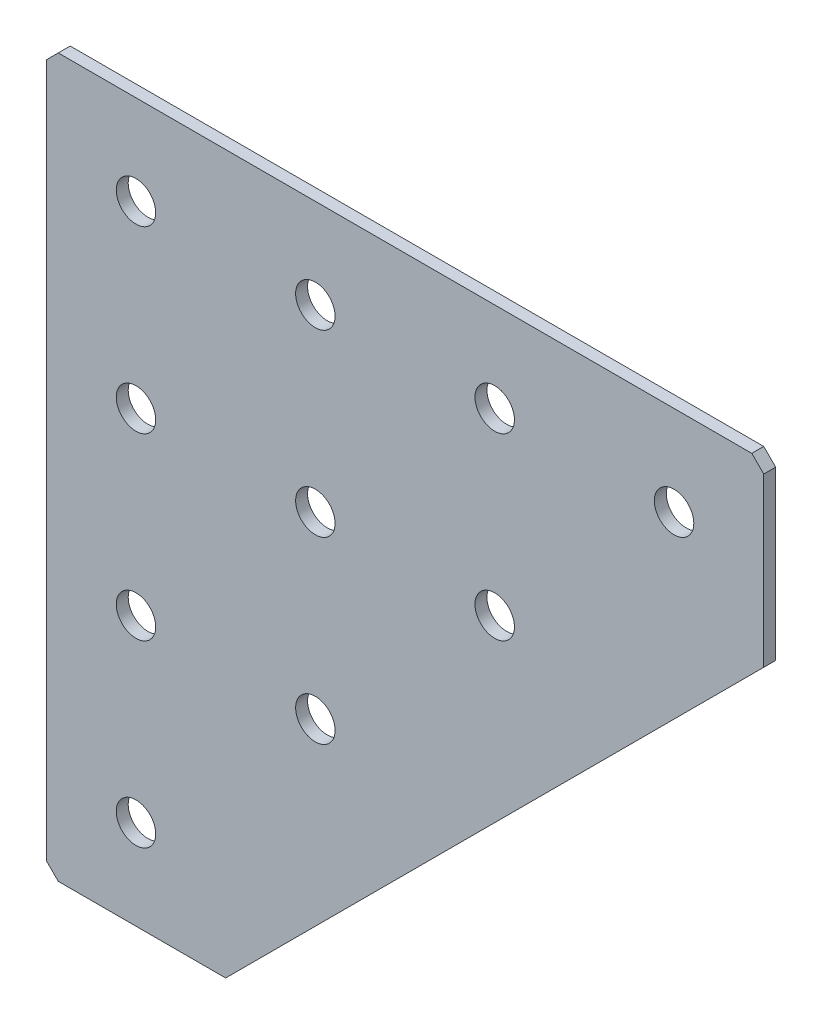
ISO-10303-21;
HEADER;
FILE_DESCRIPTION(('STEP AP214'),'2;1');
FILE_NAME('part.step','',(''),(''),'','','');
FILE_SCHEMA(('AUTOMOTIVE_DESIGN { 1 0 10303 214 1 1 1 1 }'));
ENDSEC;
DATA;
#1=APPLICATION_CONTEXT('core data for automotive mechanical design processes');
#2=APPLICATION_PROTOCOL_DEFINITION('international standard','automotive_design',2000,#1);
#3=PRODUCT_CONTEXT('',#1,'mechanical');
#4=PRODUCT('Part','Part','',(#3));
#5=PRODUCT_RELATED_PRODUCT_CATEGORY('part','',(#4));
#6=PRODUCT_DEFINITION_FORMATION('','',#4);
#7=PRODUCT_DEFINITION_CONTEXT('part definition',#1,'design');
#8=PRODUCT_DEFINITION('design','',#6,#7);
#9=PRODUCT_DEFINITION_SHAPE('','',#8);
#10=(LENGTH_UNIT() NAMED_UNIT(*) SI_UNIT(.MILLI.,.METRE.));
#11=(NAMED_UNIT(*) PLANE_ANGLE_UNIT() SI_UNIT($,.RADIAN.));
#12=(NAMED_UNIT(*) SI_UNIT($,.STERADIAN.) SOLID_ANGLE_UNIT());
#13=UNCERTAINTY_MEASURE_WITH_UNIT(LENGTH_MEASURE(1.E-05),#10,'distance_accuracy_value','');
#14=(GEOMETRIC_REPRESENTATION_CONTEXT(3) GLOBAL_UNCERTAINTY_ASSIGNED_CONTEXT((#13)) GLOBAL_UNIT_ASSIGNED_CONTEXT((#10,
#11,#12)) REPRESENTATION_CONTEXT('',''));
#15=CARTESIAN_POINT('',(0.,0.,0.));
#16=DIRECTION('',(0.,0.,1.));
#17=DIRECTION('',(1.,0.,0.));
#18=AXIS2_PLACEMENT_3D('',#15,#16,#17);
#19=CARTESIAN_POINT('',(0.,0.,0.));
#20=DIRECTION('',(0.,0.,-1.));
#21=DIRECTION('',(-1.,0.,0.));
#22=AXIS2_PLACEMENT_3D('',#19,#20,#21);
#23=PLANE('',#22);
#24=CARTESIAN_POINT('',(15.,45.,0.));
#25=DIRECTION('',(0.,0.,1.));
#26=DIRECTION('',(1.,0.,0.));
#27=AXIS2_PLACEMENT_3D('',#24,#25,#26);
#28=CIRCLE('',#27,3.29999999999999);
#29=CARTESIAN_POINT('',(18.3,45.,0.));
#30=VERTEX_POINT('',#29);
#31=EDGE_CURVE('E182',#30,#30,#28,.T.);
#32=ORIENTED_EDGE('',*,*,#31,.F.);
#33=EDGE_LOOP('',(#32));
#34=FACE_BOUND('',#33,.T.);
#35=CARTESIAN_POINT('',(75.,105.,0.));
#36=DIRECTION('',(0.,0.,1.));
#37=DIRECTION('',(1.,0.,0.));
#38=AXIS2_PLACEMENT_3D('',#35,#36,#37);
#39=CIRCLE('',#38,3.29999999999998);
#40=CARTESIAN_POINT('',(78.3,105.,0.));
#41=VERTEX_POINT('',#40);
#42=EDGE_CURVE('E178',#41,#41,#39,.T.);
#43=ORIENTED_EDGE('',*,*,#42,.F.);
#44=EDGE_LOOP('',(#43));
#45=FACE_BOUND('',#44,.T.);
#46=CARTESIAN_POINT('',(45.,75.,0.));
#47=DIRECTION('',(0.,0.,1.));
#48=DIRECTION('',(1.,0.,0.));
#49=AXIS2_PLACEMENT_3D('',#46,#47,#48);
#50=CIRCLE('',#49,3.29999999999999);
#51=CARTESIAN_POINT('',(48.3,75.,0.));
#52=VERTEX_POINT('',#51);
#53=EDGE_CURVE('E177',#52,#52,#50,.T.);
#54=ORIENTED_EDGE('',*,*,#53,.F.);
#55=EDGE_LOOP('',(#54));
#56=FACE_BOUND('',#55,.T.);
#57=CARTESIAN_POINT('',(105.,105.,0.));
#58=DIRECTION('',(0.,0.,1.));
#59=DIRECTION('',(1.,0.,0.));
#60=AXIS2_PLACEMENT_3D('',#57,#58,#59);
#61=CIRCLE('',#60,3.3);
#62=CARTESIAN_POINT('',(108.3,105.,0.));
#63=VERTEX_POINT('',#62);
#64=EDGE_CURVE('E173',#63,#63,#61,.T.);
#65=ORIENTED_EDGE('',*,*,#64,.F.);
#66=EDGE_LOOP('',(#65));
#67=FACE_BOUND('',#66,.T.);
#68=CARTESIAN_POINT('',(45.,105.,0.));
#69=DIRECTION('',(0.,0.,1.));
#70=DIRECTION('',(1.,0.,0.));
#71=AXIS2_PLACEMENT_3D('',#68,#69,#70);
#72=CIRCLE('',#71,3.3);
#73=CARTESIAN_POINT('',(48.3,105.,0.));
#74=VERTEX_POINT('',#73);
#75=EDGE_CURVE('E169',#74,#74,#72,.T.);
#76=ORIENTED_EDGE('',*,*,#75,.F.);
#77=EDGE_LOOP('',(#76));
#78=FACE_BOUND('',#77,.T.);
#79=CARTESIAN_POINT('',(15.,105.,0.));
#80=DIRECTION('',(0.,0.,1.));
#81=DIRECTION('',(1.,0.,0.));
#82=AXIS2_PLACEMENT_3D('',#79,#80,#81);
#83=CIRCLE('',#82,3.3);
#84=CARTESIAN_POINT('',(18.3,105.,0.));
#85=VERTEX_POINT('',#84);
#86=EDGE_CURVE('E165',#85,#85,#83,.T.);
#87=ORIENTED_EDGE('',*,*,#86,.F.);
#88=EDGE_LOOP('',(#87));
#89=FACE_BOUND('',#88,.T.);
#90=CARTESIAN_POINT('',(15.,15.,0.));
#91=DIRECTION('',(0.,0.,1.));
#92=DIRECTION('',(1.,0.,0.));
#93=AXIS2_PLACEMENT_3D('',#90,#91,#92);
#94=CIRCLE('',#93,3.3);
#95=CARTESIAN_POINT('',(18.3,15.,0.));
#96=VERTEX_POINT('',#95);
#97=EDGE_CURVE('E161',#96,#96,#94,.T.);
#98=ORIENTED_EDGE('',*,*,#97,.F.);
#99=EDGE_LOOP('',(#98));
#100=FACE_BOUND('',#99,.T.);
#101=CARTESIAN_POINT('',(15.,75.,0.));
#102=DIRECTION('',(0.,0.,1.));
#103=DIRECTION('',(1.,0.,0.));
#104=AXIS2_PLACEMENT_3D('',#101,#102,#103);
#105=CIRCLE('',#104,3.3);
#106=CARTESIAN_POINT('',(18.3,75.,0.));
#107=VERTEX_POINT('',#106);
#108=EDGE_CURVE('E157',#107,#107,#105,.T.);
#109=ORIENTED_EDGE('',*,*,#108,.F.);
#110=EDGE_LOOP('',(#109));
#111=FACE_BOUND('',#110,.T.);
#112=CARTESIAN_POINT('',(45.,45.,0.));
#113=DIRECTION('',(0.,0.,1.));
#114=DIRECTION('',(1.,0.,0.));
#115=AXIS2_PLACEMENT_3D('',#112,#113,#114);
#116=CIRCLE('',#115,3.3);
#117=CARTESIAN_POINT('',(48.3,45.,0.));
#118=VERTEX_POINT('',#117);
#119=EDGE_CURVE('E153',#118,#118,#116,.T.);
#120=ORIENTED_EDGE('',*,*,#119,.F.);
#121=EDGE_LOOP('',(#120));
#122=FACE_BOUND('',#121,.T.);
#123=DIRECTION('',(-1.,0.,0.));
#124=VECTOR('',#123,1.);
#125=CARTESIAN_POINT('',(0.,120.,0.));
#126=LINE('',#125,#124);
#127=CARTESIAN_POINT('',(118.,120.,0.));
#128=VERTEX_POINT('',#127);
#129=CARTESIAN_POINT('',(2.00000000000003,120.,0.));
#130=VERTEX_POINT('',#129);
#131=EDGE_CURVE('E142',#128,#130,#126,.T.);
#132=ORIENTED_EDGE('',*,*,#131,.T.);
#133=DIRECTION('',(0.707106781186548,0.707106781186548,0.));
#134=VECTOR('',#133,1.);
#135=CARTESIAN_POINT('',(2.00000000000003,120.,0.));
#136=LINE('',#135,#134);
#137=CARTESIAN_POINT('',(0.,118.,0.));
#138=VERTEX_POINT('',#137);
#139=EDGE_CURVE('E191',#130,#138,#136,.F.);
#140=ORIENTED_EDGE('',*,*,#139,.T.);
#141=DIRECTION('',(0.,-1.,0.));
#142=VECTOR('',#141,1.);
#143=CARTESIAN_POINT('',(0.,0.,0.));
#144=LINE('',#143,#142);
#145=CARTESIAN_POINT('',(0.,2.00000000000003,0.));
#146=VERTEX_POINT('',#145);
#147=EDGE_CURVE('E113',#138,#146,#144,.T.);
#148=ORIENTED_EDGE('',*,*,#147,.T.);
#149=DIRECTION('',(-0.707106781186548,0.707106781186548,0.));
#150=VECTOR('',#149,1.);
#151=CARTESIAN_POINT('',(0.,2.00000000000003,0.));
#152=LINE('',#151,#150);
#153=CARTESIAN_POINT('',(2.00000000000003,0.,0.));
#154=VERTEX_POINT('',#153);
#155=EDGE_CURVE('E189',#146,#154,#152,.F.);
#156=ORIENTED_EDGE('',*,*,#155,.T.);
#157=DIRECTION('',(1.,0.,0.));
#158=VECTOR('',#157,1.);
#159=CARTESIAN_POINT('',(0.,0.,0.));
#160=LINE('',#159,#158);
#161=CARTESIAN_POINT('',(30.,0.,0.));
#162=VERTEX_POINT('',#161);
#163=EDGE_CURVE('E135',#154,#162,#160,.T.);
#164=ORIENTED_EDGE('',*,*,#163,.T.);
#165=DIRECTION('',(0.707106781186548,0.707106781186548,0.));
#166=VECTOR('',#165,1.);
#167=CARTESIAN_POINT('',(120.,90.,0.));
#168=LINE('',#167,#166);
#169=CARTESIAN_POINT('',(120.,90.,0.));
#170=VERTEX_POINT('',#169);
#171=EDGE_CURVE('E119',#162,#170,#168,.T.);
#172=ORIENTED_EDGE('',*,*,#171,.T.);
#173=DIRECTION('',(0.,1.,0.));
#174=VECTOR('',#173,1.);
#175=CARTESIAN_POINT('',(120.,120.,0.));
#176=LINE('',#175,#174);
#177=CARTESIAN_POINT('',(120.,118.,0.));
#178=VERTEX_POINT('',#177);
#179=EDGE_CURVE('E139',#170,#178,#176,.T.);
#180=ORIENTED_EDGE('',*,*,#179,.T.);
#181=DIRECTION('',(0.707106781186548,-0.707106781186548,0.));
#182=VECTOR('',#181,1.);
#183=CARTESIAN_POINT('',(120.,118.,0.));
#184=LINE('',#183,#182);
#185=EDGE_CURVE('E187',#178,#128,#184,.F.);
#186=ORIENTED_EDGE('',*,*,#185,.T.);
#187=EDGE_LOOP('',(#132,#140,#148,#156,#164,#172,#180,#186));
#188=FACE_BOUND('',#187,.T.);
#189=CARTESIAN_POINT('',(75.,75.,0.));
#190=DIRECTION('',(0.,0.,1.));
#191=DIRECTION('',(1.,0.,0.));
#192=AXIS2_PLACEMENT_3D('',#189,#190,#191);
#193=CIRCLE('',#192,3.3);
#194=CARTESIAN_POINT('',(78.3,75.,0.));
#195=VERTEX_POINT('',#194);
#196=EDGE_CURVE('E152',#195,#195,#193,.T.);
#197=ORIENTED_EDGE('',*,*,#196,.F.);
#198=EDGE_LOOP('',(#197));
#199=FACE_BOUND('',#198,.T.);
#200=ADVANCED_FACE('F40',(#34,#45,#56,#67,#78,#89,#100,#111,#122,#188,#199),#23,.F.);
#201=CARTESIAN_POINT('',(0.,0.,-2.));
#202=DIRECTION('',(0.,-1.,0.));
#203=DIRECTION('',(0.,0.,-1.));
#204=AXIS2_PLACEMENT_3D('',#201,#202,#203);
#205=PLANE('',#204);
#206=ORIENTED_EDGE('',*,*,#163,.F.);
#207=DIRECTION('',(0.,0.,-1.));
#208=VECTOR('',#207,1.);
#209=CARTESIAN_POINT('',(2.00000000000003,0.,-2.));
#210=LINE('',#209,#208);
#211=CARTESIAN_POINT('',(2.00000000000003,0.,-2.));
#212=VERTEX_POINT('',#211);
#213=EDGE_CURVE('E48',#154,#212,#210,.T.);
#214=ORIENTED_EDGE('',*,*,#213,.T.);
#215=DIRECTION('',(1.,0.,0.));
#216=VECTOR('',#215,1.);
#217=CARTESIAN_POINT('',(0.,0.,-2.));
#218=LINE('',#217,#216);
#219=CARTESIAN_POINT('',(30.,0.,-2.));
#220=VERTEX_POINT('',#219);
#221=EDGE_CURVE('E105',#212,#220,#218,.T.);
#222=ORIENTED_EDGE('',*,*,#221,.T.);
#223=DIRECTION('',(0.,0.,1.));
#224=VECTOR('',#223,1.);
#225=CARTESIAN_POINT('',(30.,0.,-2.));
#226=LINE('',#225,#224);
#227=EDGE_CURVE('E108',#220,#162,#226,.T.);
#228=ORIENTED_EDGE('',*,*,#227,.T.);
#229=EDGE_LOOP('',(#206,#214,#222,#228));
#230=FACE_BOUND('',#229,.T.);
#231=ADVANCED_FACE('F107',(#230),#205,.T.);
#232=CARTESIAN_POINT('',(0.,0.,-2.));
#233=DIRECTION('',(-1.,0.,0.));
#234=DIRECTION('',(0.,0.,1.));
#235=AXIS2_PLACEMENT_3D('',#232,#233,#234);
#236=PLANE('',#235);
#237=ORIENTED_EDGE('',*,*,#147,.F.);
#238=DIRECTION('',(0.,0.,-1.));
#239=VECTOR('',#238,1.);
#240=CARTESIAN_POINT('',(0.,118.,-2.));
#241=LINE('',#240,#239);
#242=CARTESIAN_POINT('',(0.,118.,-2.));
#243=VERTEX_POINT('',#242);
#244=EDGE_CURVE('E196',#138,#243,#241,.T.);
#245=ORIENTED_EDGE('',*,*,#244,.T.);
#246=DIRECTION('',(0.,-1.,0.));
#247=VECTOR('',#246,1.);
#248=CARTESIAN_POINT('',(0.,0.,-2.));
#249=LINE('',#248,#247);
#250=CARTESIAN_POINT('',(0.,2.00000000000003,-2.));
#251=VERTEX_POINT('',#250);
#252=EDGE_CURVE('E121',#243,#251,#249,.T.);
#253=ORIENTED_EDGE('',*,*,#252,.T.);
#254=DIRECTION('',(0.,0.,1.));
#255=VECTOR('',#254,1.);
#256=CARTESIAN_POINT('',(0.,2.00000000000003,-2.));
#257=LINE('',#256,#255);
#258=EDGE_CURVE('E193',#251,#146,#257,.T.);
#259=ORIENTED_EDGE('',*,*,#258,.T.);
#260=EDGE_LOOP('',(#237,#245,#253,#259));
#261=FACE_BOUND('',#260,.T.);
#262=ADVANCED_FACE('F215',(#261),#236,.T.);
#263=CARTESIAN_POINT('',(0.,120.,-2.));
#264=DIRECTION('',(0.,1.,0.));
#265=DIRECTION('',(0.,0.,1.));
#266=AXIS2_PLACEMENT_3D('',#263,#264,#265);
#267=PLANE('',#266);
#268=DIRECTION('',(-1.,0.,0.));
#269=VECTOR('',#268,1.);
#270=CARTESIAN_POINT('',(0.,120.,-2.));
#271=LINE('',#270,#269);
#272=CARTESIAN_POINT('',(118.,120.,-2.));
#273=VERTEX_POINT('',#272);
#274=CARTESIAN_POINT('',(2.00000000000003,120.,-2.));
#275=VERTEX_POINT('',#274);
#276=EDGE_CURVE('E127',#273,#275,#271,.T.);
#277=ORIENTED_EDGE('',*,*,#276,.T.);
#278=DIRECTION('',(0.,0.,1.));
#279=VECTOR('',#278,1.);
#280=CARTESIAN_POINT('',(2.00000000000003,120.,-2.));
#281=LINE('',#280,#279);
#282=EDGE_CURVE('E184',#275,#130,#281,.T.);
#283=ORIENTED_EDGE('',*,*,#282,.T.);
#284=ORIENTED_EDGE('',*,*,#131,.F.);
#285=DIRECTION('',(0.,0.,-1.));
#286=VECTOR('',#285,1.);
#287=CARTESIAN_POINT('',(118.,120.,-2.));
#288=LINE('',#287,#286);
#289=EDGE_CURVE('E147',#128,#273,#288,.T.);
#290=ORIENTED_EDGE('',*,*,#289,.T.);
#291=EDGE_LOOP('',(#277,#283,#284,#290));
#292=FACE_BOUND('',#291,.T.);
#293=ADVANCED_FACE('F207',(#292),#267,.T.);
#294=CARTESIAN_POINT('',(120.,120.,-2.));
#295=DIRECTION('',(1.,0.,0.));
#296=DIRECTION('',(0.,0.,-1.));
#297=AXIS2_PLACEMENT_3D('',#294,#295,#296);
#298=PLANE('',#297);
#299=DIRECTION('',(0.,1.,0.));
#300=VECTOR('',#299,1.);
#301=CARTESIAN_POINT('',(120.,120.,-2.));
#302=LINE('',#301,#300);
#303=CARTESIAN_POINT('',(120.,90.,-2.));
#304=VERTEX_POINT('',#303);
#305=CARTESIAN_POINT('',(120.,118.,-2.));
#306=VERTEX_POINT('',#305);
#307=EDGE_CURVE('E125',#304,#306,#302,.T.);
#308=ORIENTED_EDGE('',*,*,#307,.T.);
#309=DIRECTION('',(0.,0.,1.));
#310=VECTOR('',#309,1.);
#311=CARTESIAN_POINT('',(120.,118.,-2.));
#312=LINE('',#311,#310);
#313=EDGE_CURVE('E11',#306,#178,#312,.T.);
#314=ORIENTED_EDGE('',*,*,#313,.T.);
#315=ORIENTED_EDGE('',*,*,#179,.F.);
#316=DIRECTION('',(0.,0.,1.));
#317=VECTOR('',#316,1.);
#318=CARTESIAN_POINT('',(120.,90.,-2.));
#319=LINE('',#318,#317);
#320=EDGE_CURVE('E120',#304,#170,#319,.T.);
#321=ORIENTED_EDGE('',*,*,#320,.F.);
#322=EDGE_LOOP('',(#308,#314,#315,#321));
#323=FACE_BOUND('',#322,.T.);
#324=ADVANCED_FACE('F221',(#323),#298,.T.);
#325=CARTESIAN_POINT('',(120.,90.,-2.));
#326=DIRECTION('',(0.707106781186547,-0.707106781186547,0.));
#327=DIRECTION('',(0.707106781186548,0.707106781186548,0.));
#328=AXIS2_PLACEMENT_3D('',#325,#326,#327);
#329=PLANE('',#328);
#330=ORIENTED_EDGE('',*,*,#171,.F.);
#331=ORIENTED_EDGE('',*,*,#227,.F.);
#332=DIRECTION('',(0.707106781186548,0.707106781186548,0.));
#333=VECTOR('',#332,1.);
#334=CARTESIAN_POINT('',(120.,90.,-2.));
#335=LINE('',#334,#333);
#336=EDGE_CURVE('E112',#220,#304,#335,.T.);
#337=ORIENTED_EDGE('',*,*,#336,.T.);
#338=ORIENTED_EDGE('',*,*,#320,.T.);
#339=EDGE_LOOP('',(#330,#331,#337,#338));
#340=FACE_BOUND('',#339,.T.);
#341=ADVANCED_FACE('F117',(#340),#329,.T.);
#342=CARTESIAN_POINT('',(0.,0.,-2.));
#343=DIRECTION('',(0.,0.,-1.));
#344=DIRECTION('',(-1.,0.,0.));
#345=AXIS2_PLACEMENT_3D('',#342,#343,#344);
#346=PLANE('',#345);
#347=CARTESIAN_POINT('',(15.,45.,-2.));
#348=DIRECTION('',(0.,0.,-1.));
#349=DIRECTION('',(-1.,0.,0.));
#350=AXIS2_PLACEMENT_3D('',#347,#348,#349);
#351=CIRCLE('',#350,3.29999999999999);
#352=CARTESIAN_POINT('',(11.7,45.,-2.));
#353=VERTEX_POINT('',#352);
#354=EDGE_CURVE('E179',#353,#353,#351,.T.);
#355=ORIENTED_EDGE('',*,*,#354,.F.);
#356=EDGE_LOOP('',(#355));
#357=FACE_BOUND('',#356,.T.);
#358=CARTESIAN_POINT('',(75.,105.,-2.));
#359=DIRECTION('',(0.,0.,-1.));
#360=DIRECTION('',(-1.,0.,0.));
#361=AXIS2_PLACEMENT_3D('',#358,#359,#360);
#362=CIRCLE('',#361,3.29999999999998);
#363=CARTESIAN_POINT('',(71.7,105.,-2.));
#364=VERTEX_POINT('',#363);
#365=EDGE_CURVE('E174',#364,#364,#362,.T.);
#366=ORIENTED_EDGE('',*,*,#365,.F.);
#367=EDGE_LOOP('',(#366));
#368=FACE_BOUND('',#367,.T.);
#369=CARTESIAN_POINT('',(45.,75.,-2.));
#370=DIRECTION('',(0.,0.,-1.));
#371=DIRECTION('',(-1.,0.,0.));
#372=AXIS2_PLACEMENT_3D('',#369,#370,#371);
#373=CIRCLE('',#372,3.29999999999999);
#374=CARTESIAN_POINT('',(41.7,75.,-2.));
#375=VERTEX_POINT('',#374);
#376=EDGE_CURVE('E316',#375,#375,#373,.T.);
#377=ORIENTED_EDGE('',*,*,#376,.F.);
#378=EDGE_LOOP('',(#377));
#379=FACE_BOUND('',#378,.T.);
#380=CARTESIAN_POINT('',(105.,105.,-2.));
#381=DIRECTION('',(0.,0.,-1.));
#382=DIRECTION('',(-1.,0.,0.));
#383=AXIS2_PLACEMENT_3D('',#380,#381,#382);
#384=CIRCLE('',#383,3.3);
#385=CARTESIAN_POINT('',(101.7,105.,-2.));
#386=VERTEX_POINT('',#385);
#387=EDGE_CURVE('E170',#386,#386,#384,.T.);
#388=ORIENTED_EDGE('',*,*,#387,.F.);
#389=EDGE_LOOP('',(#388));
#390=FACE_BOUND('',#389,.T.);
#391=CARTESIAN_POINT('',(45.,105.,-2.));
#392=DIRECTION('',(0.,0.,-1.));
#393=DIRECTION('',(-1.,0.,0.));
#394=AXIS2_PLACEMENT_3D('',#391,#392,#393);
#395=CIRCLE('',#394,3.3);
#396=CARTESIAN_POINT('',(41.7,105.,-2.));
#397=VERTEX_POINT('',#396);
#398=EDGE_CURVE('E166',#397,#397,#395,.T.);
#399=ORIENTED_EDGE('',*,*,#398,.F.);
#400=EDGE_LOOP('',(#399));
#401=FACE_BOUND('',#400,.T.);
#402=CARTESIAN_POINT('',(15.,105.,-2.));
#403=DIRECTION('',(0.,0.,-1.));
#404=DIRECTION('',(-1.,0.,0.));
#405=AXIS2_PLACEMENT_3D('',#402,#403,#404);
#406=CIRCLE('',#405,3.3);
#407=CARTESIAN_POINT('',(11.7,105.,-2.));
#408=VERTEX_POINT('',#407);
#409=EDGE_CURVE('E162',#408,#408,#406,.T.);
#410=ORIENTED_EDGE('',*,*,#409,.F.);
#411=EDGE_LOOP('',(#410));
#412=FACE_BOUND('',#411,.T.);
#413=CARTESIAN_POINT('',(15.,15.,-2.));
#414=DIRECTION('',(0.,0.,-1.));
#415=DIRECTION('',(-1.,0.,0.));
#416=AXIS2_PLACEMENT_3D('',#413,#414,#415);
#417=CIRCLE('',#416,3.3);
#418=CARTESIAN_POINT('',(11.7,15.,-2.));
#419=VERTEX_POINT('',#418);
#420=EDGE_CURVE('E158',#419,#419,#417,.T.);
#421=ORIENTED_EDGE('',*,*,#420,.F.);
#422=EDGE_LOOP('',(#421));
#423=FACE_BOUND('',#422,.T.);
#424=CARTESIAN_POINT('',(15.,75.,-2.));
#425=DIRECTION('',(0.,0.,-1.));
#426=DIRECTION('',(-1.,0.,0.));
#427=AXIS2_PLACEMENT_3D('',#424,#425,#426);
#428=CIRCLE('',#427,3.3);
#429=CARTESIAN_POINT('',(11.7,75.,-2.));
#430=VERTEX_POINT('',#429);
#431=EDGE_CURVE('E154',#430,#430,#428,.T.);
#432=ORIENTED_EDGE('',*,*,#431,.F.);
#433=EDGE_LOOP('',(#432));
#434=FACE_BOUND('',#433,.T.);
#435=CARTESIAN_POINT('',(45.,45.,-2.));
#436=DIRECTION('',(0.,0.,-1.));
#437=DIRECTION('',(-1.,0.,0.));
#438=AXIS2_PLACEMENT_3D('',#435,#436,#437);
#439=CIRCLE('',#438,3.3);
#440=CARTESIAN_POINT('',(41.7,45.,-2.));
#441=VERTEX_POINT('',#440);
#442=EDGE_CURVE('E149',#441,#441,#439,.T.);
#443=ORIENTED_EDGE('',*,*,#442,.F.);
#444=EDGE_LOOP('',(#443));
#445=FACE_BOUND('',#444,.T.);
#446=CARTESIAN_POINT('',(75.,75.,-2.));
#447=DIRECTION('',(0.,0.,-1.));
#448=DIRECTION('',(-1.,0.,0.));
#449=AXIS2_PLACEMENT_3D('',#446,#447,#448);
#450=CIRCLE('',#449,3.3);
#451=CARTESIAN_POINT('',(71.7,75.,-2.));
#452=VERTEX_POINT('',#451);
#453=EDGE_CURVE('E137',#452,#452,#450,.T.);
#454=ORIENTED_EDGE('',*,*,#453,.F.);
#455=EDGE_LOOP('',(#454));
#456=FACE_BOUND('',#455,.T.);
#457=ORIENTED_EDGE('',*,*,#252,.F.);
#458=DIRECTION('',(-0.707106781186548,-0.707106781186548,0.));
#459=VECTOR('',#458,1.);
#460=CARTESIAN_POINT('',(-59.,59.,-2.));
#461=LINE('',#460,#459);
#462=EDGE_CURVE('E201',#243,#275,#461,.F.);
#463=ORIENTED_EDGE('',*,*,#462,.T.);
#464=ORIENTED_EDGE('',*,*,#276,.F.);
#465=DIRECTION('',(-0.707106781186548,0.707106781186548,0.));
#466=VECTOR('',#465,1.);
#467=CARTESIAN_POINT('',(119.,119.,-2.));
#468=LINE('',#467,#466);
#469=EDGE_CURVE('E55',#273,#306,#468,.F.);
#470=ORIENTED_EDGE('',*,*,#469,.T.);
#471=ORIENTED_EDGE('',*,*,#307,.F.);
#472=ORIENTED_EDGE('',*,*,#336,.F.);
#473=ORIENTED_EDGE('',*,*,#221,.F.);
#474=DIRECTION('',(0.707106781186548,-0.707106781186548,0.));
#475=VECTOR('',#474,1.);
#476=CARTESIAN_POINT('',(1.00000000000001,1.00000000000001,-2.));
#477=LINE('',#476,#475);
#478=EDGE_CURVE('E199',#212,#251,#477,.F.);
#479=ORIENTED_EDGE('',*,*,#478,.T.);
#480=EDGE_LOOP('',(#457,#463,#464,#470,#471,#472,#473,#479));
#481=FACE_BOUND('',#480,.T.);
#482=ADVANCED_FACE('F124',(#357,#368,#379,#390,#401,#412,#423,#434,#445,#456,#481),#346,.T.);
#483=CARTESIAN_POINT('',(75.,75.,0.));
#484=DIRECTION('',(0.,0.,1.));
#485=DIRECTION('',(1.,0.,0.));
#486=AXIS2_PLACEMENT_3D('',#483,#484,#485);
#487=CYLINDRICAL_SURFACE('',#486,3.3);
#488=ORIENTED_EDGE('',*,*,#453,.T.);
#489=EDGE_LOOP('',(#488));
#490=FACE_BOUND('',#489,.T.);
#491=ORIENTED_EDGE('',*,*,#196,.T.);
#492=EDGE_LOOP('',(#491));
#493=FACE_BOUND('',#492,.T.);
#494=ADVANCED_FACE('F289',(#490,#493),#487,.F.);
#495=CARTESIAN_POINT('',(45.,45.,0.));
#496=DIRECTION('',(0.,0.,1.));
#497=DIRECTION('',(1.,0.,0.));
#498=AXIS2_PLACEMENT_3D('',#495,#496,#497);
#499=CYLINDRICAL_SURFACE('',#498,3.3);
#500=ORIENTED_EDGE('',*,*,#442,.T.);
#501=EDGE_LOOP('',(#500));
#502=FACE_BOUND('',#501,.T.);
#503=ORIENTED_EDGE('',*,*,#119,.T.);
#504=EDGE_LOOP('',(#503));
#505=FACE_BOUND('',#504,.T.);
#506=ADVANCED_FACE('F286',(#502,#505),#499,.F.);
#507=CARTESIAN_POINT('',(15.,75.,0.));
#508=DIRECTION('',(0.,0.,1.));
#509=DIRECTION('',(1.,0.,0.));
#510=AXIS2_PLACEMENT_3D('',#507,#508,#509);
#511=CYLINDRICAL_SURFACE('',#510,3.3);
#512=ORIENTED_EDGE('',*,*,#431,.T.);
#513=EDGE_LOOP('',(#512));
#514=FACE_BOUND('',#513,.T.);
#515=ORIENTED_EDGE('',*,*,#108,.T.);
#516=EDGE_LOOP('',(#515));
#517=FACE_BOUND('',#516,.T.);
#518=ADVANCED_FACE('F282',(#514,#517),#511,.F.);
#519=CARTESIAN_POINT('',(15.,15.,0.));
#520=DIRECTION('',(0.,0.,1.));
#521=DIRECTION('',(1.,0.,0.));
#522=AXIS2_PLACEMENT_3D('',#519,#520,#521);
#523=CYLINDRICAL_SURFACE('',#522,3.3);
#524=ORIENTED_EDGE('',*,*,#420,.T.);
#525=EDGE_LOOP('',(#524));
#526=FACE_BOUND('',#525,.T.);
#527=ORIENTED_EDGE('',*,*,#97,.T.);
#528=EDGE_LOOP('',(#527));
#529=FACE_BOUND('',#528,.T.);
#530=ADVANCED_FACE('F278',(#526,#529),#523,.F.);
#531=CARTESIAN_POINT('',(15.,105.,0.));
#532=DIRECTION('',(0.,0.,1.));
#533=DIRECTION('',(1.,0.,0.));
#534=AXIS2_PLACEMENT_3D('',#531,#532,#533);
#535=CYLINDRICAL_SURFACE('',#534,3.3);
#536=ORIENTED_EDGE('',*,*,#409,.T.);
#537=EDGE_LOOP('',(#536));
#538=FACE_BOUND('',#537,.T.);
#539=ORIENTED_EDGE('',*,*,#86,.T.);
#540=EDGE_LOOP('',(#539));
#541=FACE_BOUND('',#540,.T.);
#542=ADVANCED_FACE('F274',(#538,#541),#535,.F.);
#543=CARTESIAN_POINT('',(45.,105.,0.));
#544=DIRECTION('',(0.,0.,1.));
#545=DIRECTION('',(1.,0.,0.));
#546=AXIS2_PLACEMENT_3D('',#543,#544,#545);
#547=CYLINDRICAL_SURFACE('',#546,3.3);
#548=ORIENTED_EDGE('',*,*,#398,.T.);
#549=EDGE_LOOP('',(#548));
#550=FACE_BOUND('',#549,.T.);
#551=ORIENTED_EDGE('',*,*,#75,.T.);
#552=EDGE_LOOP('',(#551));
#553=FACE_BOUND('',#552,.T.);
#554=ADVANCED_FACE('F270',(#550,#553),#547,.F.);
#555=CARTESIAN_POINT('',(105.,105.,0.));
#556=DIRECTION('',(0.,0.,1.));
#557=DIRECTION('',(1.,0.,0.));
#558=AXIS2_PLACEMENT_3D('',#555,#556,#557);
#559=CYLINDRICAL_SURFACE('',#558,3.3);
#560=ORIENTED_EDGE('',*,*,#387,.T.);
#561=EDGE_LOOP('',(#560));
#562=FACE_BOUND('',#561,.T.);
#563=ORIENTED_EDGE('',*,*,#64,.T.);
#564=EDGE_LOOP('',(#563));
#565=FACE_BOUND('',#564,.T.);
#566=ADVANCED_FACE('F266',(#562,#565),#559,.F.);
#567=CARTESIAN_POINT('',(45.,75.,0.));
#568=DIRECTION('',(0.,0.,1.));
#569=DIRECTION('',(1.,0.,0.));
#570=AXIS2_PLACEMENT_3D('',#567,#568,#569);
#571=CYLINDRICAL_SURFACE('',#570,3.29999999999999);
#572=ORIENTED_EDGE('',*,*,#376,.T.);
#573=EDGE_LOOP('',(#572));
#574=FACE_BOUND('',#573,.T.);
#575=ORIENTED_EDGE('',*,*,#53,.T.);
#576=EDGE_LOOP('',(#575));
#577=FACE_BOUND('',#576,.T.);
#578=ADVANCED_FACE('F259',(#574,#577),#571,.F.);
#579=CARTESIAN_POINT('',(75.,105.,0.));
#580=DIRECTION('',(0.,0.,1.));
#581=DIRECTION('',(1.,0.,0.));
#582=AXIS2_PLACEMENT_3D('',#579,#580,#581);
#583=CYLINDRICAL_SURFACE('',#582,3.29999999999998);
#584=ORIENTED_EDGE('',*,*,#365,.T.);
#585=EDGE_LOOP('',(#584));
#586=FACE_BOUND('',#585,.T.);
#587=ORIENTED_EDGE('',*,*,#42,.T.);
#588=EDGE_LOOP('',(#587));
#589=FACE_BOUND('',#588,.T.);
#590=ADVANCED_FACE('F253',(#586,#589),#583,.F.);
#591=CARTESIAN_POINT('',(15.,45.,0.));
#592=DIRECTION('',(0.,0.,1.));
#593=DIRECTION('',(1.,0.,0.));
#594=AXIS2_PLACEMENT_3D('',#591,#592,#593);
#595=CYLINDRICAL_SURFACE('',#594,3.29999999999999);
#596=ORIENTED_EDGE('',*,*,#354,.T.);
#597=EDGE_LOOP('',(#596));
#598=FACE_BOUND('',#597,.T.);
#599=ORIENTED_EDGE('',*,*,#31,.T.);
#600=EDGE_LOOP('',(#599));
#601=FACE_BOUND('',#600,.T.);
#602=ADVANCED_FACE('F249',(#598,#601),#595,.F.);
#603=CARTESIAN_POINT('',(2.00000000000003,120.,-2.));
#604=DIRECTION('',(0.707106781186547,-0.707106781186547,0.));
#605=DIRECTION('',(0.,0.,1.));
#606=AXIS2_PLACEMENT_3D('',#603,#604,#605);
#607=PLANE('',#606);
#608=ORIENTED_EDGE('',*,*,#462,.F.);
#609=ORIENTED_EDGE('',*,*,#244,.F.);
#610=ORIENTED_EDGE('',*,*,#139,.F.);
#611=ORIENTED_EDGE('',*,*,#282,.F.);
#612=EDGE_LOOP('',(#608,#609,#610,#611));
#613=FACE_BOUND('',#612,.T.);
#614=ADVANCED_FACE('F210',(#613),#607,.F.);
#615=CARTESIAN_POINT('',(0.,2.00000000000003,-2.));
#616=DIRECTION('',(0.707106781186547,0.707106781186547,0.));
#617=DIRECTION('',(0.,0.,1.));
#618=AXIS2_PLACEMENT_3D('',#615,#616,#617);
#619=PLANE('',#618);
#620=ORIENTED_EDGE('',*,*,#478,.F.);
#621=ORIENTED_EDGE('',*,*,#213,.F.);
#622=ORIENTED_EDGE('',*,*,#155,.F.);
#623=ORIENTED_EDGE('',*,*,#258,.F.);
#624=EDGE_LOOP('',(#620,#621,#622,#623));
#625=FACE_BOUND('',#624,.T.);
#626=ADVANCED_FACE('F218',(#625),#619,.F.);
#627=CARTESIAN_POINT('',(120.,118.,-2.));
#628=DIRECTION('',(-0.707106781186547,-0.707106781186547,0.));
#629=DIRECTION('',(0.,0.,1.));
#630=AXIS2_PLACEMENT_3D('',#627,#628,#629);
#631=PLANE('',#630);
#632=ORIENTED_EDGE('',*,*,#469,.F.);
#633=ORIENTED_EDGE('',*,*,#289,.F.);
#634=ORIENTED_EDGE('',*,*,#185,.F.);
#635=ORIENTED_EDGE('',*,*,#313,.F.);
#636=EDGE_LOOP('',(#632,#633,#634,#635));
#637=FACE_BOUND('',#636,.T.);
#638=ADVANCED_FACE('F42',(#637),#631,.F.);
#639=CLOSED_SHELL('',(#200,#231,#262,#293,#324,#341,#482,#494,#506,#518,#530,#542,#554,#566,
#578,#590,#602,#614,#626,#638));
#640=MANIFOLD_SOLID_BREP('B2',#639);
#641=ADVANCED_BREP_SHAPE_REPRESENTATION('',(#18,#640),#14);
#642=SHAPE_DEFINITION_REPRESENTATION(#9,#641);
ENDSEC;
END-ISO-10303-21;
